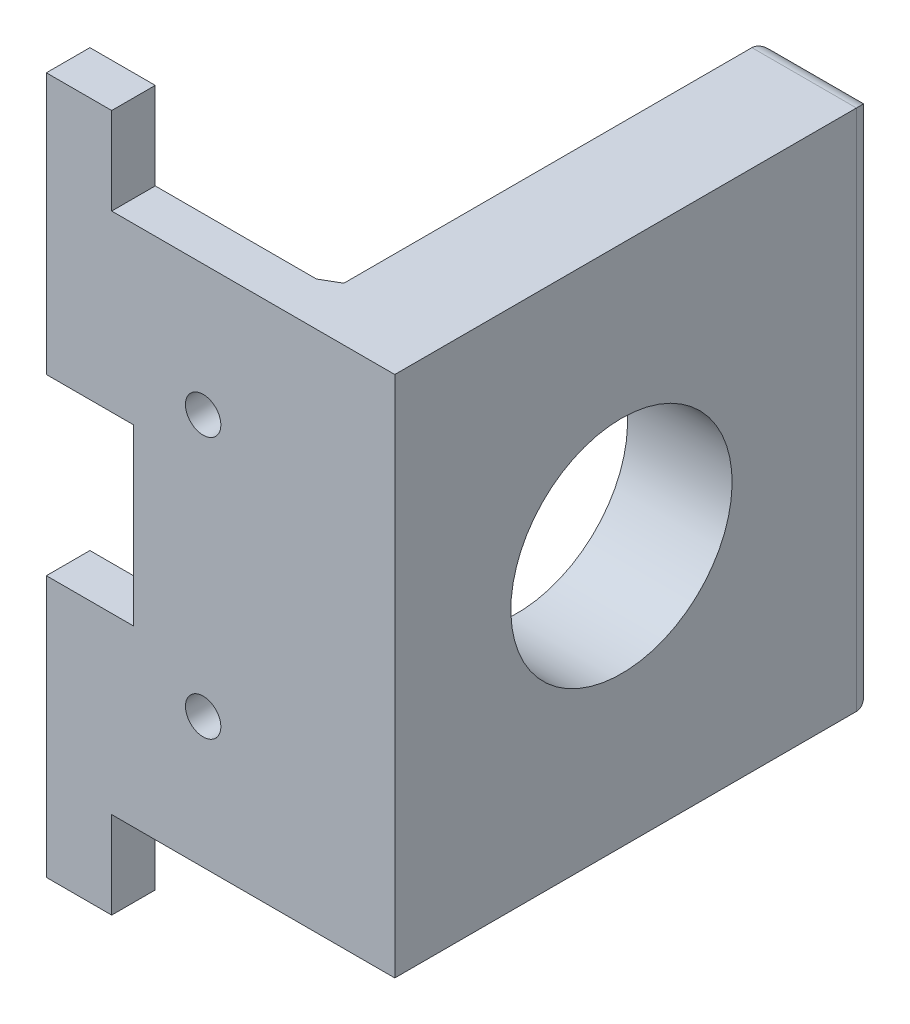
ISO-10303-21;
HEADER;
FILE_DESCRIPTION(('STEP AP214'),'2;1');
FILE_NAME('part.step','',(''),(''),'','','');
FILE_SCHEMA(('AUTOMOTIVE_DESIGN { 1 0 10303 214 1 1 1 1 }'));
ENDSEC;
DATA;
#1=APPLICATION_CONTEXT('core data for automotive mechanical design processes');
#2=APPLICATION_PROTOCOL_DEFINITION('international standard','automotive_design',2000,#1);
#3=PRODUCT_CONTEXT('',#1,'mechanical');
#4=PRODUCT('Part','Part','',(#3));
#5=PRODUCT_RELATED_PRODUCT_CATEGORY('part','',(#4));
#6=PRODUCT_DEFINITION_FORMATION('','',#4);
#7=PRODUCT_DEFINITION_CONTEXT('part definition',#1,'design');
#8=PRODUCT_DEFINITION('design','',#6,#7);
#9=PRODUCT_DEFINITION_SHAPE('','',#8);
#10=(LENGTH_UNIT() NAMED_UNIT(*) SI_UNIT(.MILLI.,.METRE.));
#11=(NAMED_UNIT(*) PLANE_ANGLE_UNIT() SI_UNIT($,.RADIAN.));
#12=(NAMED_UNIT(*) SI_UNIT($,.STERADIAN.) SOLID_ANGLE_UNIT());
#13=UNCERTAINTY_MEASURE_WITH_UNIT(LENGTH_MEASURE(1.E-05),#10,'distance_accuracy_value','');
#14=(GEOMETRIC_REPRESENTATION_CONTEXT(3) GLOBAL_UNCERTAINTY_ASSIGNED_CONTEXT((#13)) GLOBAL_UNIT_ASSIGNED_CONTEXT((#10,
#11,#12)) REPRESENTATION_CONTEXT('',''));
#15=CARTESIAN_POINT('',(0.,0.,0.));
#16=DIRECTION('',(0.,0.,1.));
#17=DIRECTION('',(1.,0.,0.));
#18=AXIS2_PLACEMENT_3D('',#15,#16,#17);
#19=CARTESIAN_POINT('',(-50.8000000000003,88.9000000000002,-76.21));
#20=DIRECTION('',(-1.,0.,0.));
#21=DIRECTION('',(0.,-1.,0.));
#22=AXIS2_PLACEMENT_3D('',#19,#20,#21);
#23=PLANE('',#22);
#24=DIRECTION('',(0.,1.,0.));
#25=VECTOR('',#24,1.);
#26=CARTESIAN_POINT('',(-50.7999999999999,-2.40548322002117E-13,0.));
#27=LINE('',#26,#25);
#28=CARTESIAN_POINT('',(-50.8000000000001,50.8000000000002,0.));
#29=VERTEX_POINT('',#28);
#30=CARTESIAN_POINT('',(-50.8000000000003,88.9,0.));
#31=VERTEX_POINT('',#30);
#32=EDGE_CURVE('E237',#29,#31,#27,.T.);
#33=ORIENTED_EDGE('',*,*,#32,.F.);
#34=DIRECTION('',(0.,0.,1.));
#35=VECTOR('',#34,1.);
#36=CARTESIAN_POINT('',(-50.8000000000001,50.8000000000002,-76.21));
#37=LINE('',#36,#35);
#38=CARTESIAN_POINT('',(-50.8000000000001,50.8000000000002,6.35));
#39=VERTEX_POINT('',#38);
#40=EDGE_CURVE('E11',#29,#39,#37,.T.);
#41=ORIENTED_EDGE('',*,*,#40,.T.);
#42=DIRECTION('',(0.,1.,0.));
#43=VECTOR('',#42,1.);
#44=CARTESIAN_POINT('',(-50.7999999999999,-2.40548322002117E-13,6.35));
#45=LINE('',#44,#43);
#46=CARTESIAN_POINT('',(-50.8000000000003,88.9,6.34999999999999));
#47=VERTEX_POINT('',#46);
#48=EDGE_CURVE('E205',#39,#47,#45,.T.);
#49=ORIENTED_EDGE('',*,*,#48,.T.);
#50=DIRECTION('',(0.,0.,1.));
#51=VECTOR('',#50,1.);
#52=CARTESIAN_POINT('',(-50.8000000000003,88.9,0.));
#53=LINE('',#52,#51);
#54=EDGE_CURVE('E235',#31,#47,#53,.T.);
#55=ORIENTED_EDGE('',*,*,#54,.F.);
#56=EDGE_LOOP('',(#33,#41,#49,#55));
#57=FACE_BOUND('',#56,.T.);
#58=ADVANCED_FACE('F33',(#57),#23,.T.);
#59=CARTESIAN_POINT('',(-50.8000000000001,50.8000000000002,-76.21));
#60=DIRECTION('',(0.,-1.,0.));
#61=DIRECTION('',(1.,0.,0.));
#62=AXIS2_PLACEMENT_3D('',#59,#60,#61);
#63=PLANE('',#62);
#64=DIRECTION('',(-1.,0.,0.));
#65=VECTOR('',#64,1.);
#66=CARTESIAN_POINT('',(8.32667268468854E-13,50.7999999999994,0.));
#67=LINE('',#66,#65);
#68=CARTESIAN_POINT('',(-38.1000000000001,50.8,0.));
#69=VERTEX_POINT('',#68);
#70=EDGE_CURVE('E240',#69,#29,#67,.T.);
#71=ORIENTED_EDGE('',*,*,#70,.F.);
#72=DIRECTION('',(0.,0.,1.));
#73=VECTOR('',#72,1.);
#74=CARTESIAN_POINT('',(-38.1000000000001,50.8,-76.21));
#75=LINE('',#74,#73);
#76=CARTESIAN_POINT('',(-38.1000000000001,50.8,6.35));
#77=VERTEX_POINT('',#76);
#78=EDGE_CURVE('E43',#69,#77,#75,.T.);
#79=ORIENTED_EDGE('',*,*,#78,.T.);
#80=DIRECTION('',(-1.,0.,0.));
#81=VECTOR('',#80,1.);
#82=CARTESIAN_POINT('',(8.32667268468854E-13,50.7999999999994,6.35));
#83=LINE('',#82,#81);
#84=EDGE_CURVE('E202',#77,#39,#83,.T.);
#85=ORIENTED_EDGE('',*,*,#84,.T.);
#86=ORIENTED_EDGE('',*,*,#40,.F.);
#87=EDGE_LOOP('',(#71,#79,#85,#86));
#88=FACE_BOUND('',#87,.T.);
#89=ADVANCED_FACE('F248',(#88),#63,.T.);
#90=CARTESIAN_POINT('',(-38.1000000000001,25.4,-76.21));
#91=DIRECTION('',(-1.,0.,0.));
#92=DIRECTION('',(0.,0.,1.));
#93=AXIS2_PLACEMENT_3D('',#90,#91,#92);
#94=PLANE('',#93);
#95=DIRECTION('',(0.,1.,0.));
#96=VECTOR('',#95,1.);
#97=CARTESIAN_POINT('',(-38.1000000000001,0.,0.));
#98=LINE('',#97,#96);
#99=CARTESIAN_POINT('',(-38.1000000000001,25.4,0.));
#100=VERTEX_POINT('',#99);
#101=EDGE_CURVE('E189',#100,#69,#98,.T.);
#102=ORIENTED_EDGE('',*,*,#101,.F.);
#103=DIRECTION('',(0.,0.,1.));
#104=VECTOR('',#103,1.);
#105=CARTESIAN_POINT('',(-38.1000000000001,25.4,-76.21));
#106=LINE('',#105,#104);
#107=CARTESIAN_POINT('',(-38.1000000000001,25.4,6.35));
#108=VERTEX_POINT('',#107);
#109=EDGE_CURVE('E180',#100,#108,#106,.T.);
#110=ORIENTED_EDGE('',*,*,#109,.T.);
#111=DIRECTION('',(0.,1.,0.));
#112=VECTOR('',#111,1.);
#113=CARTESIAN_POINT('',(-38.1000000000001,0.,6.35));
#114=LINE('',#113,#112);
#115=EDGE_CURVE('E199',#108,#77,#114,.T.);
#116=ORIENTED_EDGE('',*,*,#115,.T.);
#117=ORIENTED_EDGE('',*,*,#78,.F.);
#118=EDGE_LOOP('',(#102,#110,#116,#117));
#119=FACE_BOUND('',#118,.T.);
#120=ADVANCED_FACE('F244',(#119),#94,.T.);
#121=CARTESIAN_POINT('',(-50.8000000000001,-12.7,-76.21));
#122=DIRECTION('',(-1.,0.,0.));
#123=DIRECTION('',(0.,0.,1.));
#124=AXIS2_PLACEMENT_3D('',#121,#122,#123);
#125=PLANE('',#124);
#126=DIRECTION('',(0.,1.,0.));
#127=VECTOR('',#126,1.);
#128=CARTESIAN_POINT('',(-50.8000000000001,0.,0.));
#129=LINE('',#128,#127);
#130=CARTESIAN_POINT('',(-50.8000000000001,-12.7,0.));
#131=VERTEX_POINT('',#130);
#132=CARTESIAN_POINT('',(-50.8000000000001,25.4,0.));
#133=VERTEX_POINT('',#132);
#134=EDGE_CURVE('E174',#131,#133,#129,.T.);
#135=ORIENTED_EDGE('',*,*,#134,.F.);
#136=DIRECTION('',(0.,0.,-1.));
#137=VECTOR('',#136,1.);
#138=CARTESIAN_POINT('',(-50.8000000000001,-12.7,0.));
#139=LINE('',#138,#137);
#140=CARTESIAN_POINT('',(-50.8000000000001,-12.7,6.34999999999999));
#141=VERTEX_POINT('',#140);
#142=EDGE_CURVE('E232',#141,#131,#139,.T.);
#143=ORIENTED_EDGE('',*,*,#142,.F.);
#144=DIRECTION('',(0.,1.,0.));
#145=VECTOR('',#144,1.);
#146=CARTESIAN_POINT('',(-50.8000000000001,0.,6.35));
#147=LINE('',#146,#145);
#148=CARTESIAN_POINT('',(-50.8000000000001,25.4,6.35));
#149=VERTEX_POINT('',#148);
#150=EDGE_CURVE('E176',#141,#149,#147,.T.);
#151=ORIENTED_EDGE('',*,*,#150,.T.);
#152=DIRECTION('',(0.,0.,1.));
#153=VECTOR('',#152,1.);
#154=CARTESIAN_POINT('',(-50.8000000000001,25.4,-76.21));
#155=LINE('',#154,#153);
#156=EDGE_CURVE('E170',#133,#149,#155,.T.);
#157=ORIENTED_EDGE('',*,*,#156,.F.);
#158=EDGE_LOOP('',(#135,#143,#151,#157));
#159=FACE_BOUND('',#158,.T.);
#160=ADVANCED_FACE('F172',(#159),#125,.T.);
#161=CARTESIAN_POINT('',(-50.8000000000001,25.4,-76.21));
#162=DIRECTION('',(0.,1.,0.));
#163=DIRECTION('',(0.,0.,1.));
#164=AXIS2_PLACEMENT_3D('',#161,#162,#163);
#165=PLANE('',#164);
#166=DIRECTION('',(1.,0.,0.));
#167=VECTOR('',#166,1.);
#168=CARTESIAN_POINT('',(0.,25.4,0.));
#169=LINE('',#168,#167);
#170=EDGE_CURVE('E184',#133,#100,#169,.T.);
#171=ORIENTED_EDGE('',*,*,#170,.F.);
#172=ORIENTED_EDGE('',*,*,#156,.T.);
#173=DIRECTION('',(1.,0.,0.));
#174=VECTOR('',#173,1.);
#175=CARTESIAN_POINT('',(0.,25.4,6.35));
#176=LINE('',#175,#174);
#177=EDGE_CURVE('E194',#149,#108,#176,.T.);
#178=ORIENTED_EDGE('',*,*,#177,.T.);
#179=ORIENTED_EDGE('',*,*,#109,.F.);
#180=EDGE_LOOP('',(#171,#172,#178,#179));
#181=FACE_BOUND('',#180,.T.);
#182=ADVANCED_FACE('F185',(#181),#165,.T.);
#183=CARTESIAN_POINT('',(0.,0.,-63.5));
#184=DIRECTION('',(0.,0.,-1.));
#185=DIRECTION('',(-1.,0.,0.));
#186=AXIS2_PLACEMENT_3D('',#183,#184,#185);
#187=PLANE('',#186);
#188=DIRECTION('',(0.,-1.,0.));
#189=VECTOR('',#188,1.);
#190=CARTESIAN_POINT('',(-2.54,0.,-63.5));
#191=LINE('',#190,#189);
#192=CARTESIAN_POINT('',(-2.54,73.66,-63.5));
#193=VERTEX_POINT('',#192);
#194=CARTESIAN_POINT('',(-2.54,2.54,-63.5));
#195=VERTEX_POINT('',#194);
#196=EDGE_CURVE('E307',#193,#195,#191,.T.);
#197=ORIENTED_EDGE('',*,*,#196,.T.);
#198=DIRECTION('',(-1.,0.,0.));
#199=VECTOR('',#198,1.);
#200=CARTESIAN_POINT('',(-15.24,2.54,-63.5));
#201=LINE('',#200,#199);
#202=CARTESIAN_POINT('',(-12.7,2.54,-63.5));
#203=VERTEX_POINT('',#202);
#204=EDGE_CURVE('E313',#195,#203,#201,.T.);
#205=ORIENTED_EDGE('',*,*,#204,.T.);
#206=DIRECTION('',(0.,1.,0.));
#207=VECTOR('',#206,1.);
#208=CARTESIAN_POINT('',(-12.7,76.2,-63.5));
#209=LINE('',#208,#207);
#210=CARTESIAN_POINT('',(-12.7,73.66,-63.5));
#211=VERTEX_POINT('',#210);
#212=EDGE_CURVE('E311',#203,#211,#209,.T.);
#213=ORIENTED_EDGE('',*,*,#212,.T.);
#214=DIRECTION('',(1.,0.,0.));
#215=VECTOR('',#214,1.);
#216=CARTESIAN_POINT('',(0.,73.66,-63.5));
#217=LINE('',#216,#215);
#218=EDGE_CURVE('E309',#211,#193,#217,.T.);
#219=ORIENTED_EDGE('',*,*,#218,.T.);
#220=EDGE_LOOP('',(#197,#205,#213,#219));
#221=FACE_BOUND('',#220,.T.);
#222=ADVANCED_FACE('F367',(#221),#187,.T.);
#223=CARTESIAN_POINT('',(-12.7,0.,-60.96));
#224=DIRECTION('',(0.,-1.,0.));
#225=DIRECTION('',(1.,0.,0.));
#226=AXIS2_PLACEMENT_3D('',#223,#224,#225);
#227=CYLINDRICAL_SURFACE('',#226,2.54);
#228=CARTESIAN_POINT('',(-12.7,73.66,-60.96));
#229=DIRECTION('',(0.707106781186547,0.707106781186548,0.));
#230=DIRECTION('',(0.707106781186547,-0.707106781186547,0.));
#231=AXIS2_PLACEMENT_3D('',#228,#229,#230);
#232=ELLIPSE('',#231,3.59210244842766,2.54);
#233=CARTESIAN_POINT('',(-15.24,76.2,-60.96));
#234=VERTEX_POINT('',#233);
#235=EDGE_CURVE('E327',#234,#211,#232,.F.);
#236=ORIENTED_EDGE('',*,*,#235,.T.);
#237=ORIENTED_EDGE('',*,*,#212,.F.);
#238=CARTESIAN_POINT('',(-12.7,2.54,-60.96));
#239=DIRECTION('',(0.707106781186547,-0.707106781186548,0.));
#240=DIRECTION('',(-0.707106781186547,-0.707106781186547,0.));
#241=AXIS2_PLACEMENT_3D('',#238,#239,#240);
#242=ELLIPSE('',#241,3.59210244842766,2.54);
#243=CARTESIAN_POINT('',(-15.24,0.,-60.96));
#244=VERTEX_POINT('',#243);
#245=EDGE_CURVE('E272',#244,#203,#242,.T.);
#246=ORIENTED_EDGE('',*,*,#245,.F.);
#247=DIRECTION('',(0.,1.,0.));
#248=VECTOR('',#247,1.);
#249=CARTESIAN_POINT('',(-15.24,0.,-60.96));
#250=LINE('',#249,#248);
#251=EDGE_CURVE('E319',#234,#244,#250,.F.);
#252=ORIENTED_EDGE('',*,*,#251,.F.);
#253=EDGE_LOOP('',(#236,#237,#246,#252));
#254=FACE_BOUND('',#253,.T.);
#255=ADVANCED_FACE('F369',(#254),#227,.T.);
#256=CARTESIAN_POINT('',(0.,73.66,-60.96));
#257=DIRECTION('',(1.,0.,0.));
#258=DIRECTION('',(0.,1.,0.));
#259=AXIS2_PLACEMENT_3D('',#256,#257,#258);
#260=CYLINDRICAL_SURFACE('',#259,2.54);
#261=ORIENTED_EDGE('',*,*,#235,.F.);
#262=DIRECTION('',(1.,0.,0.));
#263=VECTOR('',#262,1.);
#264=CARTESIAN_POINT('',(-101.6,76.2,-60.96));
#265=LINE('',#264,#263);
#266=CARTESIAN_POINT('',(0.,76.2,-60.96));
#267=VERTEX_POINT('',#266);
#268=EDGE_CURVE('E321',#267,#234,#265,.F.);
#269=ORIENTED_EDGE('',*,*,#268,.F.);
#270=CARTESIAN_POINT('',(-2.54,73.66,-60.96));
#271=DIRECTION('',(0.707106781186548,-0.707106781186547,0.));
#272=DIRECTION('',(-0.707106781186547,-0.707106781186548,0.));
#273=AXIS2_PLACEMENT_3D('',#270,#271,#272);
#274=ELLIPSE('',#273,3.59210244842766,2.54);
#275=EDGE_CURVE('E275',#193,#267,#274,.T.);
#276=ORIENTED_EDGE('',*,*,#275,.F.);
#277=ORIENTED_EDGE('',*,*,#218,.F.);
#278=EDGE_LOOP('',(#261,#269,#276,#277));
#279=FACE_BOUND('',#278,.T.);
#280=ADVANCED_FACE('F341',(#279),#260,.T.);
#281=CARTESIAN_POINT('',(-2.54,0.,-60.96));
#282=DIRECTION('',(0.,-1.,0.));
#283=DIRECTION('',(1.,0.,0.));
#284=AXIS2_PLACEMENT_3D('',#281,#282,#283);
#285=CYLINDRICAL_SURFACE('',#284,2.54);
#286=ORIENTED_EDGE('',*,*,#275,.T.);
#287=DIRECTION('',(0.,-1.,0.));
#288=VECTOR('',#287,1.);
#289=CARTESIAN_POINT('',(0.,76.2,-60.96));
#290=LINE('',#289,#288);
#291=CARTESIAN_POINT('',(0.,0.,-60.96));
#292=VERTEX_POINT('',#291);
#293=EDGE_CURVE('E234',#292,#267,#290,.F.);
#294=ORIENTED_EDGE('',*,*,#293,.F.);
#295=CARTESIAN_POINT('',(-2.54,2.54,-60.96));
#296=DIRECTION('',(-0.707106781186547,-0.707106781186547,0.));
#297=DIRECTION('',(0.707106781186547,-0.707106781186547,0.));
#298=AXIS2_PLACEMENT_3D('',#295,#296,#297);
#299=ELLIPSE('',#298,3.59210244842766,2.54);
#300=EDGE_CURVE('E325',#195,#292,#299,.T.);
#301=ORIENTED_EDGE('',*,*,#300,.F.);
#302=ORIENTED_EDGE('',*,*,#196,.F.);
#303=EDGE_LOOP('',(#286,#294,#301,#302));
#304=FACE_BOUND('',#303,.T.);
#305=ADVANCED_FACE('F335',(#304),#285,.T.);
#306=CARTESIAN_POINT('',(-101.601,38.019999999998,-26.700000000002));
#307=DIRECTION('',(1.,0.,0.));
#308=DIRECTION('',(0.,1.,0.));
#309=AXIS2_PLACEMENT_3D('',#306,#307,#308);
#310=CYLINDRICAL_SURFACE('',#309,16.129);
#311=CARTESIAN_POINT('',(0.,38.019999999998,-26.700000000002));
#312=DIRECTION('',(1.,0.,0.));
#313=DIRECTION('',(0.,1.,0.));
#314=AXIS2_PLACEMENT_3D('',#311,#312,#313);
#315=CIRCLE('',#314,16.129);
#316=CARTESIAN_POINT('',(0.,54.148999999998,-26.700000000002));
#317=VERTEX_POINT('',#316);
#318=EDGE_CURVE('E261',#317,#317,#315,.T.);
#319=CARTESIAN_POINT('',(-15.24,38.019999999998,-26.700000000002));
#320=DIRECTION('',(1.,0.,0.));
#321=DIRECTION('',(0.,1.,0.));
#322=AXIS2_PLACEMENT_3D('',#319,#320,#321);
#323=CIRCLE('',#322,16.129);
#324=CARTESIAN_POINT('',(-15.24,54.148999999998,-26.700000000002));
#325=VERTEX_POINT('',#324);
#326=EDGE_CURVE('E269',#325,#325,#323,.F.);
#327=CARTESIAN_POINT('',(0.,54.148999999998,-26.700000000002));
#328=CARTESIAN_POINT('',(-0.158749999999999,54.148999999998,-26.700000000002));
#329=CARTESIAN_POINT('',(-0.317499999999998,54.148999999998,-26.700000000002));
#330=CARTESIAN_POINT('',(-0.634999999999997,54.148999999998,-26.700000000002));
#331=CARTESIAN_POINT('',(-0.793749999999996,54.148999999998,-26.700000000002));
#332=CARTESIAN_POINT('',(-1.11124999999999,54.148999999998,-26.700000000002));
#333=CARTESIAN_POINT('',(-1.26999999999999,54.148999999998,-26.700000000002));
#334=CARTESIAN_POINT('',(-1.58749999999999,54.148999999998,-26.700000000002));
#335=CARTESIAN_POINT('',(-1.74624999999999,54.148999999998,-26.700000000002));
#336=CARTESIAN_POINT('',(-2.06374999999999,54.148999999998,-26.700000000002));
#337=CARTESIAN_POINT('',(-2.2225,54.148999999998,-26.700000000002));
#338=CARTESIAN_POINT('',(-2.54,54.148999999998,-26.700000000002));
#339=CARTESIAN_POINT('',(-2.69875,54.148999999998,-26.700000000002));
#340=CARTESIAN_POINT('',(-3.01625,54.148999999998,-26.700000000002));
#341=CARTESIAN_POINT('',(-3.175,54.148999999998,-26.700000000002));
#342=CARTESIAN_POINT('',(-3.4925,54.148999999998,-26.700000000002));
#343=CARTESIAN_POINT('',(-3.65124999999999,54.148999999998,-26.700000000002));
#344=CARTESIAN_POINT('',(-3.96874999999999,54.148999999998,-26.700000000002));
#345=CARTESIAN_POINT('',(-4.12749999999999,54.148999999998,-26.700000000002));
#346=CARTESIAN_POINT('',(-4.44499999999999,54.148999999998,-26.700000000002));
#347=CARTESIAN_POINT('',(-4.60374999999999,54.148999999998,-26.700000000002));
#348=CARTESIAN_POINT('',(-4.92124999999999,54.148999999998,-26.700000000002));
#349=CARTESIAN_POINT('',(-5.07999999999999,54.148999999998,-26.700000000002));
#350=CARTESIAN_POINT('',(-5.39749999999999,54.148999999998,-26.700000000002));
#351=CARTESIAN_POINT('',(-5.55624999999999,54.148999999998,-26.700000000002));
#352=CARTESIAN_POINT('',(-5.87375,54.148999999998,-26.700000000002));
#353=CARTESIAN_POINT('',(-6.0325,54.148999999998,-26.700000000002));
#354=CARTESIAN_POINT('',(-6.34999999999999,54.148999999998,-26.700000000002));
#355=CARTESIAN_POINT('',(-6.50874999999999,54.148999999998,-26.700000000002));
#356=CARTESIAN_POINT('',(-6.82624999999999,54.148999999998,-26.700000000002));
#357=CARTESIAN_POINT('',(-6.98499999999999,54.148999999998,-26.700000000002));
#358=CARTESIAN_POINT('',(-7.30249999999999,54.148999999998,-26.700000000002));
#359=CARTESIAN_POINT('',(-7.46124999999999,54.148999999998,-26.700000000002));
#360=CARTESIAN_POINT('',(-7.77874999999999,54.148999999998,-26.700000000002));
#361=CARTESIAN_POINT('',(-7.93749999999999,54.148999999998,-26.700000000002));
#362=CARTESIAN_POINT('',(-8.25499999999998,54.148999999998,-26.700000000002));
#363=CARTESIAN_POINT('',(-8.41374999999998,54.148999999998,-26.700000000002));
#364=CARTESIAN_POINT('',(-8.73124999999998,54.148999999998,-26.700000000002));
#365=CARTESIAN_POINT('',(-8.88999999999998,54.148999999998,-26.700000000002));
#366=CARTESIAN_POINT('',(-9.20749999999998,54.148999999998,-26.700000000002));
#367=CARTESIAN_POINT('',(-9.36624999999998,54.148999999998,-26.700000000002));
#368=CARTESIAN_POINT('',(-9.68374999999998,54.148999999998,-26.700000000002));
#369=CARTESIAN_POINT('',(-9.84249999999999,54.148999999998,-26.700000000002));
#370=CARTESIAN_POINT('',(-10.16,54.148999999998,-26.700000000002));
#371=CARTESIAN_POINT('',(-10.31875,54.148999999998,-26.700000000002));
#372=CARTESIAN_POINT('',(-10.63625,54.148999999998,-26.700000000002));
#373=CARTESIAN_POINT('',(-10.795,54.148999999998,-26.700000000002));
#374=CARTESIAN_POINT('',(-11.1125,54.148999999998,-26.700000000002));
#375=CARTESIAN_POINT('',(-11.27125,54.148999999998,-26.700000000002));
#376=CARTESIAN_POINT('',(-11.58875,54.148999999998,-26.700000000002));
#377=CARTESIAN_POINT('',(-11.7475,54.148999999998,-26.700000000002));
#378=CARTESIAN_POINT('',(-12.065,54.148999999998,-26.700000000002));
#379=CARTESIAN_POINT('',(-12.22375,54.148999999998,-26.700000000002));
#380=CARTESIAN_POINT('',(-12.54125,54.148999999998,-26.700000000002));
#381=CARTESIAN_POINT('',(-12.7,54.148999999998,-26.700000000002));
#382=CARTESIAN_POINT('',(-13.0175,54.148999999998,-26.700000000002));
#383=CARTESIAN_POINT('',(-13.17625,54.148999999998,-26.700000000002));
#384=CARTESIAN_POINT('',(-13.49375,54.148999999998,-26.700000000002));
#385=CARTESIAN_POINT('',(-13.6525,54.148999999998,-26.700000000002));
#386=CARTESIAN_POINT('',(-13.97,54.148999999998,-26.700000000002));
#387=CARTESIAN_POINT('',(-14.12875,54.148999999998,-26.700000000002));
#388=CARTESIAN_POINT('',(-14.44625,54.148999999998,-26.700000000002));
#389=CARTESIAN_POINT('',(-14.605,54.148999999998,-26.700000000002));
#390=CARTESIAN_POINT('',(-14.9225,54.148999999998,-26.700000000002));
#391=CARTESIAN_POINT('',(-15.08125,54.148999999998,-26.700000000002));
#392=CARTESIAN_POINT('',(-15.24,54.148999999998,-26.700000000002));
#393=B_SPLINE_CURVE_WITH_KNOTS('',3,(#327,#328,#329,#330,#331,#332,#333,#334,#335,#336,#337,
#338,#339,#340,#341,#342,#343,#344,#345,#346,#347,#348,#349,#350,#351,#352,#353,#354,#355,#356,
#357,#358,#359,#360,#361,#362,#363,#364,#365,#366,#367,#368,#369,#370,#371,#372,#373,#374,#375,
#376,#377,#378,#379,#380,#381,#382,#383,#384,#385,#386,#387,#388,#389,#390,#391,#392),
.UNSPECIFIED.,.F.,.F.,(4,2,2,2,2,2,2,2,2,2,2,2,2,2,2,2,2,2,2,2,2,2,2,2,2,2,2,2,2,2,2,2,4),(0.,
0.476249999999998,0.952499999999995,1.42874999999999,1.90499999999999,2.38125,2.8575,3.33375,
3.80999999999999,4.28624999999999,4.76249999999999,5.23874999999999,5.715,6.19125,
6.66749999999999,7.14374999999999,7.61999999999999,8.09624999999999,8.57249999999998,
9.04874999999998,9.52499999999998,10.00125,10.4775,10.95375,11.43,11.90625,12.3825,12.85875,
13.335,13.81125,14.2875,14.76375,15.24),.UNSPECIFIED.);
#394=EDGE_CURVE('BSEAM382',#317,#325,#393,.T.);
#395=ORIENTED_EDGE('',*,*,#318,.T.);
#396=ORIENTED_EDGE('',*,*,#326,.T.);
#397=ORIENTED_EDGE('',*,*,#394,.T.);
#398=ORIENTED_EDGE('',*,*,#394,.F.);
#399=EDGE_LOOP('',(#395,#397,#396,#398));
#400=FACE_BOUND('',#399,.T.);
#401=ADVANCED_FACE('F382',(#400),#310,.F.);
#402=CARTESIAN_POINT('',(0.,2.54,-60.96));
#403=DIRECTION('',(1.,0.,0.));
#404=DIRECTION('',(0.,0.,-1.));
#405=AXIS2_PLACEMENT_3D('',#402,#403,#404);
#406=CYLINDRICAL_SURFACE('',#405,2.54);
#407=ORIENTED_EDGE('',*,*,#300,.T.);
#408=DIRECTION('',(-1.,0.,0.));
#409=VECTOR('',#408,1.);
#410=CARTESIAN_POINT('',(0.,0.,-60.96));
#411=LINE('',#410,#409);
#412=EDGE_CURVE('E316',#244,#292,#411,.F.);
#413=ORIENTED_EDGE('',*,*,#412,.F.);
#414=ORIENTED_EDGE('',*,*,#245,.T.);
#415=ORIENTED_EDGE('',*,*,#204,.F.);
#416=EDGE_LOOP('',(#407,#413,#414,#415));
#417=FACE_BOUND('',#416,.T.);
#418=ADVANCED_FACE('F385',(#417),#406,.T.);
#419=CARTESIAN_POINT('',(-15.24,76.2,-63.5));
#420=DIRECTION('',(1.,0.,0.));
#421=DIRECTION('',(0.,1.,0.));
#422=AXIS2_PLACEMENT_3D('',#419,#420,#421);
#423=PLANE('',#422);
#424=ORIENTED_EDGE('',*,*,#326,.F.);
#425=EDGE_LOOP('',(#424));
#426=FACE_BOUND('',#425,.T.);
#427=DIRECTION('',(0.,0.,1.));
#428=VECTOR('',#427,1.);
#429=CARTESIAN_POINT('',(-15.24,76.2,-63.5));
#430=LINE('',#429,#428);
#431=CARTESIAN_POINT('',(-15.24,76.2,-1.46646968374164));
#432=VERTEX_POINT('',#431);
#433=EDGE_CURVE('E276',#234,#432,#430,.T.);
#434=ORIENTED_EDGE('',*,*,#433,.F.);
#435=ORIENTED_EDGE('',*,*,#251,.T.);
#436=DIRECTION('',(0.,0.,1.));
#437=VECTOR('',#436,1.);
#438=CARTESIAN_POINT('',(-15.24,0.,-63.5));
#439=LINE('',#438,#437);
#440=CARTESIAN_POINT('',(-15.24,0.,-1.46646968374164));
#441=VERTEX_POINT('',#440);
#442=EDGE_CURVE('E273',#244,#441,#439,.T.);
#443=ORIENTED_EDGE('',*,*,#442,.T.);
#444=DIRECTION('',(0.,1.,0.));
#445=VECTOR('',#444,1.);
#446=CARTESIAN_POINT('',(-15.24,76.2,-1.46646968374164));
#447=LINE('',#446,#445);
#448=EDGE_CURVE('E295',#441,#432,#447,.T.);
#449=ORIENTED_EDGE('',*,*,#448,.T.);
#450=EDGE_LOOP('',(#434,#435,#443,#449));
#451=FACE_BOUND('',#450,.T.);
#452=ADVANCED_FACE('F347',(#426,#451),#423,.F.);
#453=CARTESIAN_POINT('',(-15.24,76.2,-1.46646968374164));
#454=DIRECTION('',(0.500000000000005,0.,0.866025403784436));
#455=DIRECTION('',(0.,1.,0.));
#456=AXIS2_PLACEMENT_3D('',#453,#454,#455);
#457=PLANE('',#456);
#458=DIRECTION('',(0.866025403784436,0.,-0.500000000000005));
#459=VECTOR('',#458,1.);
#460=CARTESIAN_POINT('',(-83.3946306570153,0.,37.8826246726062));
#461=LINE('',#460,#459);
#462=CARTESIAN_POINT('',(-17.78,0.,0.));
#463=VERTEX_POINT('',#462);
#464=EDGE_CURVE('E304',#463,#441,#461,.T.);
#465=ORIENTED_EDGE('',*,*,#464,.F.);
#466=DIRECTION('',(0.,-1.,0.));
#467=VECTOR('',#466,1.);
#468=CARTESIAN_POINT('',(-17.78,0.,0.));
#469=LINE('',#468,#467);
#470=CARTESIAN_POINT('',(-17.78,76.2,0.));
#471=VERTEX_POINT('',#470);
#472=EDGE_CURVE('E298',#471,#463,#469,.T.);
#473=ORIENTED_EDGE('',*,*,#472,.F.);
#474=DIRECTION('',(-0.866025403784436,0.,0.500000000000005));
#475=VECTOR('',#474,1.);
#476=CARTESIAN_POINT('',(-15.24,76.2,-1.46646968374164));
#477=LINE('',#476,#475);
#478=EDGE_CURVE('E301',#432,#471,#477,.T.);
#479=ORIENTED_EDGE('',*,*,#478,.F.);
#480=ORIENTED_EDGE('',*,*,#448,.F.);
#481=EDGE_LOOP('',(#465,#473,#479,#480));
#482=FACE_BOUND('',#481,.T.);
#483=ADVANCED_FACE('F352',(#482),#457,.F.);
#484=CARTESIAN_POINT('',(-101.6,76.2,6.35));
#485=DIRECTION('',(0.,1.,0.));
#486=DIRECTION('',(-1.,0.,0.));
#487=AXIS2_PLACEMENT_3D('',#484,#485,#486);
#488=PLANE('',#487);
#489=DIRECTION('',(1.,0.,0.));
#490=VECTOR('',#489,1.);
#491=CARTESIAN_POINT('',(-101.6,76.2,0.));
#492=LINE('',#491,#490);
#493=CARTESIAN_POINT('',(-41.275,76.2,0.));
#494=VERTEX_POINT('',#493);
#495=EDGE_CURVE('E212',#494,#471,#492,.T.);
#496=ORIENTED_EDGE('',*,*,#495,.F.);
#497=DIRECTION('',(0.,0.,-1.));
#498=VECTOR('',#497,1.);
#499=CARTESIAN_POINT('',(-41.275,76.2,6.34999999999999));
#500=LINE('',#499,#498);
#501=CARTESIAN_POINT('',(-41.275,76.2,6.34999999999999));
#502=VERTEX_POINT('',#501);
#503=EDGE_CURVE('E221',#502,#494,#500,.T.);
#504=ORIENTED_EDGE('',*,*,#503,.F.);
#505=DIRECTION('',(1.,0.,0.));
#506=VECTOR('',#505,1.);
#507=CARTESIAN_POINT('',(-101.6,76.2,6.35));
#508=LINE('',#507,#506);
#509=CARTESIAN_POINT('',(0.,76.2,6.35));
#510=VERTEX_POINT('',#509);
#511=EDGE_CURVE('E70',#502,#510,#508,.T.);
#512=ORIENTED_EDGE('',*,*,#511,.T.);
#513=DIRECTION('',(0.,0.,-1.));
#514=VECTOR('',#513,1.);
#515=CARTESIAN_POINT('',(0.,76.2,6.35));
#516=LINE('',#515,#514);
#517=EDGE_CURVE('E210',#510,#267,#516,.T.);
#518=ORIENTED_EDGE('',*,*,#517,.T.);
#519=ORIENTED_EDGE('',*,*,#268,.T.);
#520=ORIENTED_EDGE('',*,*,#433,.T.);
#521=ORIENTED_EDGE('',*,*,#478,.T.);
#522=EDGE_LOOP('',(#496,#504,#512,#518,#519,#520,#521));
#523=FACE_BOUND('',#522,.T.);
#524=ADVANCED_FACE('F344',(#523),#488,.T.);
#525=CARTESIAN_POINT('',(0.,76.2,6.35));
#526=DIRECTION('',(1.,0.,0.));
#527=DIRECTION('',(0.,1.,0.));
#528=AXIS2_PLACEMENT_3D('',#525,#526,#527);
#529=PLANE('',#528);
#530=ORIENTED_EDGE('',*,*,#318,.F.);
#531=EDGE_LOOP('',(#530));
#532=FACE_BOUND('',#531,.T.);
#533=DIRECTION('',(0.,0.,-1.));
#534=VECTOR('',#533,1.);
#535=CARTESIAN_POINT('',(0.,0.,6.35));
#536=LINE('',#535,#534);
#537=CARTESIAN_POINT('',(0.,0.,6.35));
#538=VERTEX_POINT('',#537);
#539=EDGE_CURVE('E292',#538,#292,#536,.T.);
#540=ORIENTED_EDGE('',*,*,#539,.T.);
#541=ORIENTED_EDGE('',*,*,#293,.T.);
#542=ORIENTED_EDGE('',*,*,#517,.F.);
#543=DIRECTION('',(0.,-1.,0.));
#544=VECTOR('',#543,1.);
#545=CARTESIAN_POINT('',(0.,76.2,6.35));
#546=LINE('',#545,#544);
#547=EDGE_CURVE('E209',#510,#538,#546,.T.);
#548=ORIENTED_EDGE('',*,*,#547,.T.);
#549=EDGE_LOOP('',(#540,#541,#542,#548));
#550=FACE_BOUND('',#549,.T.);
#551=ADVANCED_FACE('F403',(#532,#550),#529,.T.);
#552=CARTESIAN_POINT('',(-101.6,0.,6.35));
#553=DIRECTION('',(0.,1.,0.));
#554=DIRECTION('',(0.,0.,1.));
#555=AXIS2_PLACEMENT_3D('',#552,#553,#554);
#556=PLANE('',#555);
#557=DIRECTION('',(1.,0.,0.));
#558=VECTOR('',#557,1.);
#559=CARTESIAN_POINT('',(-101.6,0.,6.35));
#560=LINE('',#559,#558);
#561=CARTESIAN_POINT('',(-41.275,0.,6.35));
#562=VERTEX_POINT('',#561);
#563=EDGE_CURVE('E86',#562,#538,#560,.T.);
#564=ORIENTED_EDGE('',*,*,#563,.F.);
#565=DIRECTION('',(0.,0.,-1.));
#566=VECTOR('',#565,1.);
#567=CARTESIAN_POINT('',(-41.275,0.,6.34999999999999));
#568=LINE('',#567,#566);
#569=CARTESIAN_POINT('',(-41.275,0.,0.));
#570=VERTEX_POINT('',#569);
#571=EDGE_CURVE('E181',#562,#570,#568,.T.);
#572=ORIENTED_EDGE('',*,*,#571,.T.);
#573=DIRECTION('',(1.,0.,0.));
#574=VECTOR('',#573,1.);
#575=CARTESIAN_POINT('',(-101.6,0.,0.));
#576=LINE('',#575,#574);
#577=EDGE_CURVE('E214',#570,#463,#576,.T.);
#578=ORIENTED_EDGE('',*,*,#577,.T.);
#579=ORIENTED_EDGE('',*,*,#464,.T.);
#580=ORIENTED_EDGE('',*,*,#442,.F.);
#581=ORIENTED_EDGE('',*,*,#412,.T.);
#582=ORIENTED_EDGE('',*,*,#539,.F.);
#583=EDGE_LOOP('',(#564,#572,#578,#579,#580,#581,#582));
#584=FACE_BOUND('',#583,.T.);
#585=ADVANCED_FACE('F356',(#584),#556,.F.);
#586=CARTESIAN_POINT('',(-27.94,57.15,6.35));
#587=DIRECTION('',(0.,0.,1.));
#588=DIRECTION('',(1.,0.,0.));
#589=AXIS2_PLACEMENT_3D('',#586,#587,#588);
#590=CYLINDRICAL_SURFACE('',#589,2.57975099999999);
#591=CARTESIAN_POINT('',(-27.94,57.15,0.));
#592=DIRECTION('',(0.,0.,1.));
#593=DIRECTION('',(1.,0.,0.));
#594=AXIS2_PLACEMENT_3D('',#591,#592,#593);
#595=CIRCLE('',#594,2.57975099999999);
#596=CARTESIAN_POINT('',(-25.360249,57.15,0.));
#597=VERTEX_POINT('',#596);
#598=EDGE_CURVE('E281',#597,#597,#595,.T.);
#599=ORIENTED_EDGE('',*,*,#598,.F.);
#600=EDGE_LOOP('',(#599));
#601=FACE_BOUND('',#600,.T.);
#602=CARTESIAN_POINT('',(-27.94,57.15,6.35));
#603=DIRECTION('',(0.,0.,1.));
#604=DIRECTION('',(1.,0.,0.));
#605=AXIS2_PLACEMENT_3D('',#602,#603,#604);
#606=CIRCLE('',#605,2.579751);
#607=CARTESIAN_POINT('',(-25.360249,57.15,6.35));
#608=VERTEX_POINT('',#607);
#609=EDGE_CURVE('E278',#608,#608,#606,.T.);
#610=ORIENTED_EDGE('',*,*,#609,.T.);
#611=EDGE_LOOP('',(#610));
#612=FACE_BOUND('',#611,.T.);
#613=ADVANCED_FACE('F402',(#601,#612),#590,.F.);
#614=CARTESIAN_POINT('',(-27.94,19.05,6.35));
#615=DIRECTION('',(0.,0.,1.));
#616=DIRECTION('',(1.,0.,0.));
#617=AXIS2_PLACEMENT_3D('',#614,#615,#616);
#618=CYLINDRICAL_SURFACE('',#617,2.57975099999999);
#619=CARTESIAN_POINT('',(-27.94,19.05,0.));
#620=DIRECTION('',(0.,0.,1.));
#621=DIRECTION('',(1.,0.,0.));
#622=AXIS2_PLACEMENT_3D('',#619,#620,#621);
#623=CIRCLE('',#622,2.57975099999999);
#624=CARTESIAN_POINT('',(-25.360249,19.05,0.));
#625=VERTEX_POINT('',#624);
#626=EDGE_CURVE('E216',#625,#625,#623,.T.);
#627=ORIENTED_EDGE('',*,*,#626,.F.);
#628=EDGE_LOOP('',(#627));
#629=FACE_BOUND('',#628,.T.);
#630=CARTESIAN_POINT('',(-27.94,19.05,6.35));
#631=DIRECTION('',(0.,0.,1.));
#632=DIRECTION('',(1.,0.,0.));
#633=AXIS2_PLACEMENT_3D('',#630,#631,#632);
#634=CIRCLE('',#633,2.579751);
#635=CARTESIAN_POINT('',(-25.360249,19.05,6.35));
#636=VERTEX_POINT('',#635);
#637=EDGE_CURVE('E284',#636,#636,#634,.T.);
#638=ORIENTED_EDGE('',*,*,#637,.T.);
#639=EDGE_LOOP('',(#638));
#640=FACE_BOUND('',#639,.T.);
#641=ADVANCED_FACE('F389',(#629,#640),#618,.F.);
#642=CARTESIAN_POINT('',(-41.275,88.9,6.34999999999999));
#643=DIRECTION('',(-1.,0.,0.));
#644=DIRECTION('',(0.,-1.,0.));
#645=AXIS2_PLACEMENT_3D('',#642,#643,#644);
#646=PLANE('',#645);
#647=ORIENTED_EDGE('',*,*,#503,.T.);
#648=DIRECTION('',(0.,-1.,0.));
#649=VECTOR('',#648,1.);
#650=CARTESIAN_POINT('',(-41.275,88.9,0.));
#651=LINE('',#650,#649);
#652=CARTESIAN_POINT('',(-41.275,88.9,0.));
#653=VERTEX_POINT('',#652);
#654=EDGE_CURVE('E219',#653,#494,#651,.T.);
#655=ORIENTED_EDGE('',*,*,#654,.F.);
#656=DIRECTION('',(0.,0.,-1.));
#657=VECTOR('',#656,1.);
#658=CARTESIAN_POINT('',(-41.275,88.9,6.34999999999999));
#659=LINE('',#658,#657);
#660=CARTESIAN_POINT('',(-41.275,88.9,6.34999999999999));
#661=VERTEX_POINT('',#660);
#662=EDGE_CURVE('E81',#661,#653,#659,.T.);
#663=ORIENTED_EDGE('',*,*,#662,.F.);
#664=DIRECTION('',(0.,-1.,0.));
#665=VECTOR('',#664,1.);
#666=CARTESIAN_POINT('',(-41.275,88.9,6.34999999999999));
#667=LINE('',#666,#665);
#668=EDGE_CURVE('E258',#661,#502,#667,.T.);
#669=ORIENTED_EDGE('',*,*,#668,.T.);
#670=EDGE_LOOP('',(#647,#655,#663,#669));
#671=FACE_BOUND('',#670,.T.);
#672=ADVANCED_FACE('F263',(#671),#646,.F.);
#673=CARTESIAN_POINT('',(-41.275,-12.7,6.34999999999999));
#674=DIRECTION('',(1.,0.,0.));
#675=DIRECTION('',(0.,1.,0.));
#676=AXIS2_PLACEMENT_3D('',#673,#674,#675);
#677=PLANE('',#676);
#678=ORIENTED_EDGE('',*,*,#571,.F.);
#679=DIRECTION('',(0.,1.,0.));
#680=VECTOR('',#679,1.);
#681=CARTESIAN_POINT('',(-41.275,-12.7,6.34999999999999));
#682=LINE('',#681,#680);
#683=CARTESIAN_POINT('',(-41.275,-12.7,6.34999999999999));
#684=VERTEX_POINT('',#683);
#685=EDGE_CURVE('E223',#684,#562,#682,.T.);
#686=ORIENTED_EDGE('',*,*,#685,.F.);
#687=DIRECTION('',(0.,0.,-1.));
#688=VECTOR('',#687,1.);
#689=CARTESIAN_POINT('',(-41.275,-12.7,6.34999999999999));
#690=LINE('',#689,#688);
#691=CARTESIAN_POINT('',(-41.275,-12.7,0.));
#692=VERTEX_POINT('',#691);
#693=EDGE_CURVE('E222',#684,#692,#690,.T.);
#694=ORIENTED_EDGE('',*,*,#693,.T.);
#695=DIRECTION('',(0.,1.,0.));
#696=VECTOR('',#695,1.);
#697=CARTESIAN_POINT('',(-41.275,-12.7,0.));
#698=LINE('',#697,#696);
#699=EDGE_CURVE('E51',#692,#570,#698,.T.);
#700=ORIENTED_EDGE('',*,*,#699,.T.);
#701=EDGE_LOOP('',(#678,#686,#694,#700));
#702=FACE_BOUND('',#701,.T.);
#703=ADVANCED_FACE('F357',(#702),#677,.T.);
#704=CARTESIAN_POINT('',(0.,0.,0.));
#705=DIRECTION('',(0.,0.,-1.));
#706=DIRECTION('',(-1.,0.,0.));
#707=AXIS2_PLACEMENT_3D('',#704,#705,#706);
#708=PLANE('',#707);
#709=ORIENTED_EDGE('',*,*,#626,.T.);
#710=EDGE_LOOP('',(#709));
#711=FACE_BOUND('',#710,.T.);
#712=ORIENTED_EDGE('',*,*,#598,.T.);
#713=EDGE_LOOP('',(#712));
#714=FACE_BOUND('',#713,.T.);
#715=DIRECTION('',(-1.,0.,0.));
#716=VECTOR('',#715,1.);
#717=CARTESIAN_POINT('',(-41.275,-12.7,0.));
#718=LINE('',#717,#716);
#719=EDGE_CURVE('E37',#692,#131,#718,.T.);
#720=ORIENTED_EDGE('',*,*,#719,.T.);
#721=ORIENTED_EDGE('',*,*,#134,.T.);
#722=ORIENTED_EDGE('',*,*,#170,.T.);
#723=ORIENTED_EDGE('',*,*,#101,.T.);
#724=ORIENTED_EDGE('',*,*,#70,.T.);
#725=ORIENTED_EDGE('',*,*,#32,.T.);
#726=DIRECTION('',(-1.,0.,0.));
#727=VECTOR('',#726,1.);
#728=CARTESIAN_POINT('',(-41.275,88.9,0.));
#729=LINE('',#728,#727);
#730=EDGE_CURVE('E217',#653,#31,#729,.T.);
#731=ORIENTED_EDGE('',*,*,#730,.F.);
#732=ORIENTED_EDGE('',*,*,#654,.T.);
#733=ORIENTED_EDGE('',*,*,#495,.T.);
#734=ORIENTED_EDGE('',*,*,#472,.T.);
#735=ORIENTED_EDGE('',*,*,#577,.F.);
#736=ORIENTED_EDGE('',*,*,#699,.F.);
#737=EDGE_LOOP('',(#720,#721,#722,#723,#724,#725,#731,#732,#733,#734,#735,#736));
#738=FACE_BOUND('',#737,.T.);
#739=ADVANCED_FACE('F191',(#711,#714,#738),#708,.T.);
#740=CARTESIAN_POINT('',(0.,0.,6.35));
#741=DIRECTION('',(0.,0.,-1.));
#742=DIRECTION('',(-1.,0.,0.));
#743=AXIS2_PLACEMENT_3D('',#740,#741,#742);
#744=PLANE('',#743);
#745=ORIENTED_EDGE('',*,*,#637,.F.);
#746=EDGE_LOOP('',(#745));
#747=FACE_BOUND('',#746,.T.);
#748=ORIENTED_EDGE('',*,*,#609,.F.);
#749=EDGE_LOOP('',(#748));
#750=FACE_BOUND('',#749,.T.);
#751=ORIENTED_EDGE('',*,*,#150,.F.);
#752=DIRECTION('',(1.,0.,0.));
#753=VECTOR('',#752,1.);
#754=CARTESIAN_POINT('',(-41.275,-12.7,6.34999999999999));
#755=LINE('',#754,#753);
#756=EDGE_CURVE('E63',#141,#684,#755,.T.);
#757=ORIENTED_EDGE('',*,*,#756,.T.);
#758=ORIENTED_EDGE('',*,*,#685,.T.);
#759=ORIENTED_EDGE('',*,*,#563,.T.);
#760=ORIENTED_EDGE('',*,*,#547,.F.);
#761=ORIENTED_EDGE('',*,*,#511,.F.);
#762=ORIENTED_EDGE('',*,*,#668,.F.);
#763=DIRECTION('',(1.,0.,0.));
#764=VECTOR('',#763,1.);
#765=CARTESIAN_POINT('',(-41.275,88.9,6.34999999999999));
#766=LINE('',#765,#764);
#767=EDGE_CURVE('E220',#47,#661,#766,.T.);
#768=ORIENTED_EDGE('',*,*,#767,.F.);
#769=ORIENTED_EDGE('',*,*,#48,.F.);
#770=ORIENTED_EDGE('',*,*,#84,.F.);
#771=ORIENTED_EDGE('',*,*,#115,.F.);
#772=ORIENTED_EDGE('',*,*,#177,.F.);
#773=EDGE_LOOP('',(#751,#757,#758,#759,#760,#761,#762,#768,#769,#770,#771,#772));
#774=FACE_BOUND('',#773,.T.);
#775=ADVANCED_FACE('F256',(#747,#750,#774),#744,.F.);
#776=CARTESIAN_POINT('',(0.,-12.7,0.));
#777=DIRECTION('',(0.,-1.,0.));
#778=DIRECTION('',(-1.,0.,0.));
#779=AXIS2_PLACEMENT_3D('',#776,#777,#778);
#780=PLANE('',#779);
#781=ORIENTED_EDGE('',*,*,#756,.F.);
#782=ORIENTED_EDGE('',*,*,#142,.T.);
#783=ORIENTED_EDGE('',*,*,#719,.F.);
#784=ORIENTED_EDGE('',*,*,#693,.F.);
#785=EDGE_LOOP('',(#781,#782,#783,#784));
#786=FACE_BOUND('',#785,.T.);
#787=ADVANCED_FACE('F35',(#786),#780,.T.);
#788=CARTESIAN_POINT('',(0.,88.9,0.));
#789=DIRECTION('',(0.,1.,0.));
#790=DIRECTION('',(-1.,0.,0.));
#791=AXIS2_PLACEMENT_3D('',#788,#789,#790);
#792=PLANE('',#791);
#793=ORIENTED_EDGE('',*,*,#730,.T.);
#794=ORIENTED_EDGE('',*,*,#54,.T.);
#795=ORIENTED_EDGE('',*,*,#767,.T.);
#796=ORIENTED_EDGE('',*,*,#662,.T.);
#797=EDGE_LOOP('',(#793,#794,#795,#796));
#798=FACE_BOUND('',#797,.T.);
#799=ADVANCED_FACE('F254',(#798),#792,.T.);
#800=CLOSED_SHELL('',(#58,#89,#120,#160,#182,#222,#255,#280,#305,#401,#418,#452,#483,#524,#551,
#585,#613,#641,#672,#703,#739,#775,#787,#799));
#801=MANIFOLD_SOLID_BREP('B2',#800);
#802=ADVANCED_BREP_SHAPE_REPRESENTATION('',(#18,#801),#14);
#803=SHAPE_DEFINITION_REPRESENTATION(#9,#802);
ENDSEC;
END-ISO-10303-21;
